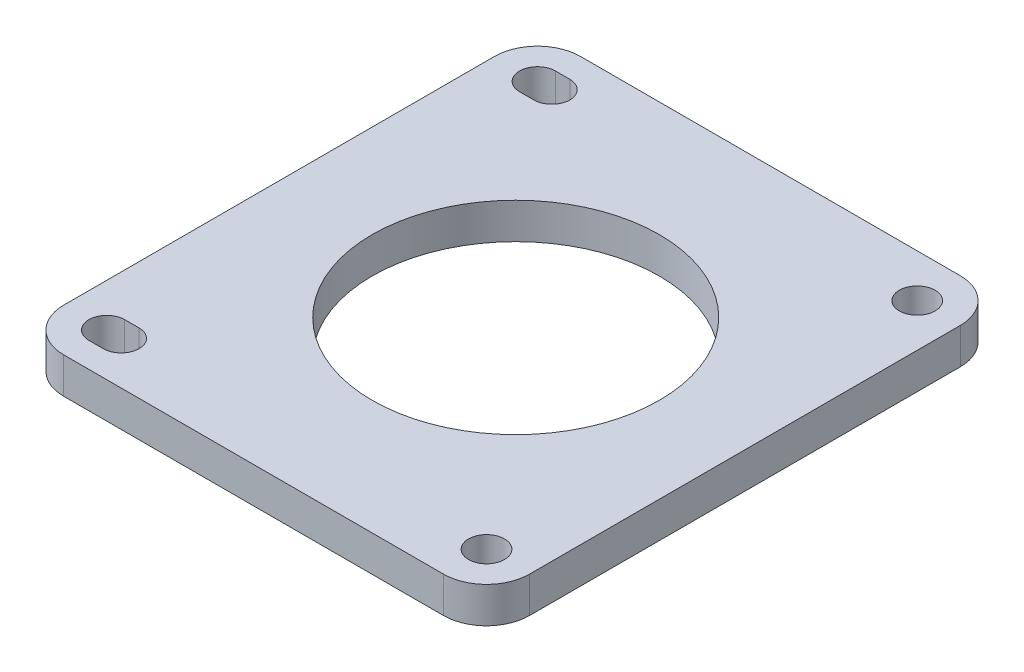
ISO-10303-21;
HEADER;
FILE_DESCRIPTION(('STEP AP214'),'2;1');
FILE_NAME('part.step','',(''),(''),'','','');
FILE_SCHEMA(('AUTOMOTIVE_DESIGN { 1 0 10303 214 1 1 1 1 }'));
ENDSEC;
DATA;
#1=APPLICATION_CONTEXT('core data for automotive mechanical design processes');
#2=APPLICATION_PROTOCOL_DEFINITION('international standard','automotive_design',2000,#1);
#3=PRODUCT_CONTEXT('',#1,'mechanical');
#4=PRODUCT('Part','Part','',(#3));
#5=PRODUCT_RELATED_PRODUCT_CATEGORY('part','',(#4));
#6=PRODUCT_DEFINITION_FORMATION('','',#4);
#7=PRODUCT_DEFINITION_CONTEXT('part definition',#1,'design');
#8=PRODUCT_DEFINITION('design','',#6,#7);
#9=PRODUCT_DEFINITION_SHAPE('','',#8);
#10=(LENGTH_UNIT() NAMED_UNIT(*) SI_UNIT(.MILLI.,.METRE.));
#11=(NAMED_UNIT(*) PLANE_ANGLE_UNIT() SI_UNIT($,.RADIAN.));
#12=(NAMED_UNIT(*) SI_UNIT($,.STERADIAN.) SOLID_ANGLE_UNIT());
#13=UNCERTAINTY_MEASURE_WITH_UNIT(LENGTH_MEASURE(1.E-05),#10,'distance_accuracy_value','');
#14=(GEOMETRIC_REPRESENTATION_CONTEXT(3) GLOBAL_UNCERTAINTY_ASSIGNED_CONTEXT((#13)) GLOBAL_UNIT_ASSIGNED_CONTEXT((#10,
#11,#12)) REPRESENTATION_CONTEXT('',''));
#15=CARTESIAN_POINT('',(0.,0.,0.));
#16=DIRECTION('',(0.,0.,1.));
#17=DIRECTION('',(1.,0.,0.));
#18=AXIS2_PLACEMENT_3D('',#15,#16,#17);
#19=CARTESIAN_POINT('',(6.,5.,-6.));
#20=DIRECTION('',(0.,-1.,0.));
#21=DIRECTION('',(0.,0.,-1.));
#22=AXIS2_PLACEMENT_3D('',#19,#20,#21);
#23=PLANE('',#22);
#24=CARTESIAN_POINT('',(6.,5.,-6.));
#25=DIRECTION('',(0.,1.,0.));
#26=DIRECTION('',(0.,0.,1.));
#27=AXIS2_PLACEMENT_3D('',#24,#25,#26);
#28=CIRCLE('',#27,2.5);
#29=CARTESIAN_POINT('',(6.,5.,-8.5));
#30=VERTEX_POINT('',#29);
#31=CARTESIAN_POINT('',(6.,5.,-3.5));
#32=VERTEX_POINT('',#31);
#33=EDGE_CURVE('E182',#30,#32,#28,.T.);
#34=ORIENTED_EDGE('',*,*,#33,.F.);
#35=DIRECTION('',(-1.,0.,0.));
#36=VECTOR('',#35,1.);
#37=CARTESIAN_POINT('',(6.,5.,-8.5));
#38=LINE('',#37,#36);
#39=CARTESIAN_POINT('',(8.,5.,-8.5));
#40=VERTEX_POINT('',#39);
#41=EDGE_CURVE('E190',#40,#30,#38,.T.);
#42=ORIENTED_EDGE('',*,*,#41,.F.);
#43=CARTESIAN_POINT('',(8.,5.,-6.));
#44=DIRECTION('',(0.,1.,0.));
#45=DIRECTION('',(0.,0.,1.));
#46=AXIS2_PLACEMENT_3D('',#43,#44,#45);
#47=CIRCLE('',#46,2.5);
#48=CARTESIAN_POINT('',(8.,5.,-3.5));
#49=VERTEX_POINT('',#48);
#50=EDGE_CURVE('E187',#49,#40,#47,.T.);
#51=ORIENTED_EDGE('',*,*,#50,.F.);
#52=DIRECTION('',(1.,0.,0.));
#53=VECTOR('',#52,1.);
#54=CARTESIAN_POINT('',(6.,5.,-3.5));
#55=LINE('',#54,#53);
#56=EDGE_CURVE('E184',#32,#49,#55,.T.);
#57=ORIENTED_EDGE('',*,*,#56,.F.);
#58=EDGE_LOOP('',(#34,#42,#51,#57));
#59=FACE_BOUND('',#58,.T.);
#60=CARTESIAN_POINT('',(6.,5.,-6.));
#61=DIRECTION('',(0.,1.,0.));
#62=DIRECTION('',(0.,0.,-1.));
#63=AXIS2_PLACEMENT_3D('',#60,#61,#62);
#64=CIRCLE('',#63,6.);
#65=CARTESIAN_POINT('',(0.,5.,-6.00000000000004));
#66=VERTEX_POINT('',#65);
#67=CARTESIAN_POINT('',(6.00000000000004,5.,0.));
#68=VERTEX_POINT('',#67);
#69=EDGE_CURVE('E231',#66,#68,#64,.T.);
#70=ORIENTED_EDGE('',*,*,#69,.T.);
#71=DIRECTION('',(1.,0.,0.));
#72=VECTOR('',#71,1.);
#73=CARTESIAN_POINT('',(6.00000000000004,5.,0.));
#74=LINE('',#73,#72);
#75=CARTESIAN_POINT('',(58.9,5.,0.));
#76=VERTEX_POINT('',#75);
#77=EDGE_CURVE('E234',#68,#76,#74,.T.);
#78=ORIENTED_EDGE('',*,*,#77,.T.);
#79=CARTESIAN_POINT('',(58.9,5.,-6.));
#80=DIRECTION('',(0.,1.,0.));
#81=DIRECTION('',(0.,0.,1.));
#82=AXIS2_PLACEMENT_3D('',#79,#80,#81);
#83=CIRCLE('',#82,6.);
#84=CARTESIAN_POINT('',(64.9,5.,-6.00000000000004));
#85=VERTEX_POINT('',#84);
#86=EDGE_CURVE('E237',#76,#85,#83,.T.);
#87=ORIENTED_EDGE('',*,*,#86,.T.);
#88=DIRECTION('',(0.,0.,-1.));
#89=VECTOR('',#88,1.);
#90=CARTESIAN_POINT('',(64.9,5.,-6.00000000000004));
#91=LINE('',#90,#89);
#92=CARTESIAN_POINT('',(64.9,5.,-65.9999999999999));
#93=VERTEX_POINT('',#92);
#94=EDGE_CURVE('E239',#85,#93,#91,.T.);
#95=ORIENTED_EDGE('',*,*,#94,.T.);
#96=CARTESIAN_POINT('',(58.9,5.,-66.));
#97=DIRECTION('',(0.,1.,0.));
#98=DIRECTION('',(0.,0.,-1.));
#99=AXIS2_PLACEMENT_3D('',#96,#97,#98);
#100=CIRCLE('',#99,6.);
#101=CARTESIAN_POINT('',(58.9,5.,-72.));
#102=VERTEX_POINT('',#101);
#103=EDGE_CURVE('E241',#93,#102,#100,.T.);
#104=ORIENTED_EDGE('',*,*,#103,.T.);
#105=DIRECTION('',(-1.,0.,0.));
#106=VECTOR('',#105,1.);
#107=CARTESIAN_POINT('',(6.00000000000004,5.,-72.));
#108=LINE('',#107,#106);
#109=CARTESIAN_POINT('',(6.00000000000004,5.,-72.));
#110=VERTEX_POINT('',#109);
#111=EDGE_CURVE('E243',#102,#110,#108,.T.);
#112=ORIENTED_EDGE('',*,*,#111,.T.);
#113=CARTESIAN_POINT('',(6.,5.,-66.));
#114=DIRECTION('',(0.,1.,0.));
#115=DIRECTION('',(0.,0.,-1.));
#116=AXIS2_PLACEMENT_3D('',#113,#114,#115);
#117=CIRCLE('',#116,6.);
#118=CARTESIAN_POINT('',(0.,5.,-65.9999999999999));
#119=VERTEX_POINT('',#118);
#120=EDGE_CURVE('E245',#110,#119,#117,.T.);
#121=ORIENTED_EDGE('',*,*,#120,.T.);
#122=DIRECTION('',(0.,0.,1.));
#123=VECTOR('',#122,1.);
#124=CARTESIAN_POINT('',(0.,5.,-6.00000000000004));
#125=LINE('',#124,#123);
#126=EDGE_CURVE('E247',#119,#66,#125,.T.);
#127=ORIENTED_EDGE('',*,*,#126,.T.);
#128=EDGE_LOOP('',(#70,#78,#87,#95,#104,#112,#121,#127));
#129=FACE_BOUND('',#128,.T.);
#130=CARTESIAN_POINT('',(58.9,5.,-66.));
#131=DIRECTION('',(0.,1.,0.));
#132=DIRECTION('',(0.,0.,1.));
#133=AXIS2_PLACEMENT_3D('',#130,#131,#132);
#134=CIRCLE('',#133,2.5);
#135=CARTESIAN_POINT('',(58.9,5.,-63.5));
#136=VERTEX_POINT('',#135);
#137=EDGE_CURVE('E225',#136,#136,#134,.T.);
#138=ORIENTED_EDGE('',*,*,#137,.F.);
#139=EDGE_LOOP('',(#138));
#140=FACE_BOUND('',#139,.T.);
#141=CARTESIAN_POINT('',(58.9,5.,-6.));
#142=DIRECTION('',(0.,1.,0.));
#143=DIRECTION('',(0.,0.,1.));
#144=AXIS2_PLACEMENT_3D('',#141,#142,#143);
#145=CIRCLE('',#144,2.5);
#146=CARTESIAN_POINT('',(58.9,5.,-3.5));
#147=VERTEX_POINT('',#146);
#148=EDGE_CURVE('E219',#147,#147,#145,.T.);
#149=ORIENTED_EDGE('',*,*,#148,.F.);
#150=EDGE_LOOP('',(#149));
#151=FACE_BOUND('',#150,.T.);
#152=CARTESIAN_POINT('',(32.97,5.,-36.));
#153=DIRECTION('',(0.,1.,0.));
#154=DIRECTION('',(0.,0.,1.));
#155=AXIS2_PLACEMENT_3D('',#152,#153,#154);
#156=CIRCLE('',#155,20.);
#157=CARTESIAN_POINT('',(32.97,5.,-16.));
#158=VERTEX_POINT('',#157);
#159=EDGE_CURVE('E213',#158,#158,#156,.T.);
#160=ORIENTED_EDGE('',*,*,#159,.F.);
#161=EDGE_LOOP('',(#160));
#162=FACE_BOUND('',#161,.T.);
#163=CARTESIAN_POINT('',(6.,5.,-66.));
#164=DIRECTION('',(0.,1.,0.));
#165=DIRECTION('',(0.,0.,1.));
#166=AXIS2_PLACEMENT_3D('',#163,#164,#165);
#167=CIRCLE('',#166,2.5);
#168=CARTESIAN_POINT('',(6.,5.,-68.5));
#169=VERTEX_POINT('',#168);
#170=CARTESIAN_POINT('',(6.,5.,-63.5));
#171=VERTEX_POINT('',#170);
#172=EDGE_CURVE('E146',#169,#171,#167,.T.);
#173=ORIENTED_EDGE('',*,*,#172,.F.);
#174=DIRECTION('',(-1.,0.,0.));
#175=VECTOR('',#174,1.);
#176=CARTESIAN_POINT('',(6.,5.,-68.5));
#177=LINE('',#176,#175);
#178=CARTESIAN_POINT('',(8.,5.,-68.5));
#179=VERTEX_POINT('',#178);
#180=EDGE_CURVE('E168',#179,#169,#177,.T.);
#181=ORIENTED_EDGE('',*,*,#180,.F.);
#182=CARTESIAN_POINT('',(8.,5.,-66.));
#183=DIRECTION('',(0.,1.,0.));
#184=DIRECTION('',(0.,0.,1.));
#185=AXIS2_PLACEMENT_3D('',#182,#183,#184);
#186=CIRCLE('',#185,2.5);
#187=CARTESIAN_POINT('',(8.,5.,-63.5));
#188=VERTEX_POINT('',#187);
#189=EDGE_CURVE('E166',#188,#179,#186,.T.);
#190=ORIENTED_EDGE('',*,*,#189,.F.);
#191=DIRECTION('',(1.,0.,0.));
#192=VECTOR('',#191,1.);
#193=CARTESIAN_POINT('',(6.,5.,-63.5));
#194=LINE('',#193,#192);
#195=EDGE_CURVE('E154',#171,#188,#194,.T.);
#196=ORIENTED_EDGE('',*,*,#195,.F.);
#197=EDGE_LOOP('',(#173,#181,#190,#196));
#198=FACE_BOUND('',#197,.T.);
#199=ADVANCED_FACE('F33',(#59,#129,#140,#151,#162,#198),#23,.F.);
#200=CARTESIAN_POINT('',(6.,0.,-6.));
#201=DIRECTION('',(0.,-1.,0.));
#202=DIRECTION('',(0.,0.,-1.));
#203=AXIS2_PLACEMENT_3D('',#200,#201,#202);
#204=PLANE('',#203);
#205=CARTESIAN_POINT('',(58.9,0.,-6.));
#206=DIRECTION('',(0.,1.,0.));
#207=DIRECTION('',(0.,0.,1.));
#208=AXIS2_PLACEMENT_3D('',#205,#206,#207);
#209=CIRCLE('',#208,2.5);
#210=CARTESIAN_POINT('',(58.9,0.,-3.5));
#211=VERTEX_POINT('',#210);
#212=EDGE_CURVE('E216',#211,#211,#209,.T.);
#213=ORIENTED_EDGE('',*,*,#212,.T.);
#214=EDGE_LOOP('',(#213));
#215=FACE_BOUND('',#214,.T.);
#216=CARTESIAN_POINT('',(6.,0.,-6.));
#217=DIRECTION('',(0.,1.,0.));
#218=DIRECTION('',(0.,0.,-1.));
#219=AXIS2_PLACEMENT_3D('',#216,#217,#218);
#220=CIRCLE('',#219,6.);
#221=CARTESIAN_POINT('',(0.,0.,-6.00000000000004));
#222=VERTEX_POINT('',#221);
#223=CARTESIAN_POINT('',(6.00000000000004,0.,0.));
#224=VERTEX_POINT('',#223);
#225=EDGE_CURVE('E228',#222,#224,#220,.T.);
#226=ORIENTED_EDGE('',*,*,#225,.F.);
#227=DIRECTION('',(0.,0.,1.));
#228=VECTOR('',#227,1.);
#229=CARTESIAN_POINT('',(0.,0.,-6.00000000000004));
#230=LINE('',#229,#228);
#231=CARTESIAN_POINT('',(0.,0.,-65.9999999999999));
#232=VERTEX_POINT('',#231);
#233=EDGE_CURVE('E235',#232,#222,#230,.T.);
#234=ORIENTED_EDGE('',*,*,#233,.F.);
#235=CARTESIAN_POINT('',(6.,0.,-66.));
#236=DIRECTION('',(0.,1.,0.));
#237=DIRECTION('',(0.,0.,-1.));
#238=AXIS2_PLACEMENT_3D('',#235,#236,#237);
#239=CIRCLE('',#238,6.);
#240=CARTESIAN_POINT('',(6.00000000000004,0.,-72.));
#241=VERTEX_POINT('',#240);
#242=EDGE_CURVE('E262',#241,#232,#239,.T.);
#243=ORIENTED_EDGE('',*,*,#242,.F.);
#244=DIRECTION('',(-1.,0.,0.));
#245=VECTOR('',#244,1.);
#246=CARTESIAN_POINT('',(6.00000000000004,0.,-72.));
#247=LINE('',#246,#245);
#248=CARTESIAN_POINT('',(58.9,0.,-72.));
#249=VERTEX_POINT('',#248);
#250=EDGE_CURVE('E260',#249,#241,#247,.T.);
#251=ORIENTED_EDGE('',*,*,#250,.F.);
#252=CARTESIAN_POINT('',(58.9,0.,-66.));
#253=DIRECTION('',(0.,1.,0.));
#254=DIRECTION('',(0.,0.,-1.));
#255=AXIS2_PLACEMENT_3D('',#252,#253,#254);
#256=CIRCLE('',#255,6.);
#257=CARTESIAN_POINT('',(64.9,0.,-65.9999999999999));
#258=VERTEX_POINT('',#257);
#259=EDGE_CURVE('E258',#258,#249,#256,.T.);
#260=ORIENTED_EDGE('',*,*,#259,.F.);
#261=DIRECTION('',(0.,0.,-1.));
#262=VECTOR('',#261,1.);
#263=CARTESIAN_POINT('',(64.9,0.,-6.00000000000004));
#264=LINE('',#263,#262);
#265=CARTESIAN_POINT('',(64.9,0.,-6.00000000000004));
#266=VERTEX_POINT('',#265);
#267=EDGE_CURVE('E256',#266,#258,#264,.T.);
#268=ORIENTED_EDGE('',*,*,#267,.F.);
#269=CARTESIAN_POINT('',(58.9,0.,-6.));
#270=DIRECTION('',(0.,1.,0.));
#271=DIRECTION('',(0.,0.,1.));
#272=AXIS2_PLACEMENT_3D('',#269,#270,#271);
#273=CIRCLE('',#272,6.);
#274=CARTESIAN_POINT('',(58.9,0.,0.));
#275=VERTEX_POINT('',#274);
#276=EDGE_CURVE('E254',#275,#266,#273,.T.);
#277=ORIENTED_EDGE('',*,*,#276,.F.);
#278=DIRECTION('',(1.,0.,0.));
#279=VECTOR('',#278,1.);
#280=CARTESIAN_POINT('',(6.00000000000004,0.,0.));
#281=LINE('',#280,#279);
#282=EDGE_CURVE('E252',#224,#275,#281,.T.);
#283=ORIENTED_EDGE('',*,*,#282,.F.);
#284=EDGE_LOOP('',(#226,#234,#243,#251,#260,#268,#277,#283));
#285=FACE_BOUND('',#284,.T.);
#286=CARTESIAN_POINT('',(58.9,0.,-66.));
#287=DIRECTION('',(0.,1.,0.));
#288=DIRECTION('',(0.,0.,1.));
#289=AXIS2_PLACEMENT_3D('',#286,#287,#288);
#290=CIRCLE('',#289,2.5);
#291=CARTESIAN_POINT('',(58.9,0.,-63.5));
#292=VERTEX_POINT('',#291);
#293=EDGE_CURVE('E222',#292,#292,#290,.T.);
#294=ORIENTED_EDGE('',*,*,#293,.T.);
#295=EDGE_LOOP('',(#294));
#296=FACE_BOUND('',#295,.T.);
#297=CARTESIAN_POINT('',(32.97,0.,-36.));
#298=DIRECTION('',(0.,1.,0.));
#299=DIRECTION('',(0.,0.,1.));
#300=AXIS2_PLACEMENT_3D('',#297,#298,#299);
#301=CIRCLE('',#300,20.);
#302=CARTESIAN_POINT('',(32.97,0.,-16.));
#303=VERTEX_POINT('',#302);
#304=EDGE_CURVE('E212',#303,#303,#301,.T.);
#305=ORIENTED_EDGE('',*,*,#304,.T.);
#306=EDGE_LOOP('',(#305));
#307=FACE_BOUND('',#306,.T.);
#308=DIRECTION('',(-1.,0.,0.));
#309=VECTOR('',#308,1.);
#310=CARTESIAN_POINT('',(6.,0.,-8.5));
#311=LINE('',#310,#309);
#312=CARTESIAN_POINT('',(8.,0.,-8.5));
#313=VERTEX_POINT('',#312);
#314=CARTESIAN_POINT('',(6.,0.,-8.5));
#315=VERTEX_POINT('',#314);
#316=EDGE_CURVE('E185',#313,#315,#311,.T.);
#317=ORIENTED_EDGE('',*,*,#316,.T.);
#318=CARTESIAN_POINT('',(6.,0.,-6.));
#319=DIRECTION('',(0.,1.,0.));
#320=DIRECTION('',(0.,0.,1.));
#321=AXIS2_PLACEMENT_3D('',#318,#319,#320);
#322=CIRCLE('',#321,2.5);
#323=CARTESIAN_POINT('',(6.,0.,-3.5));
#324=VERTEX_POINT('',#323);
#325=EDGE_CURVE('E162',#315,#324,#322,.T.);
#326=ORIENTED_EDGE('',*,*,#325,.T.);
#327=DIRECTION('',(1.,0.,0.));
#328=VECTOR('',#327,1.);
#329=CARTESIAN_POINT('',(6.,0.,-3.5));
#330=LINE('',#329,#328);
#331=CARTESIAN_POINT('',(8.,0.,-3.5));
#332=VERTEX_POINT('',#331);
#333=EDGE_CURVE('E195',#324,#332,#330,.T.);
#334=ORIENTED_EDGE('',*,*,#333,.T.);
#335=CARTESIAN_POINT('',(8.,0.,-6.));
#336=DIRECTION('',(0.,1.,0.));
#337=DIRECTION('',(0.,0.,1.));
#338=AXIS2_PLACEMENT_3D('',#335,#336,#337);
#339=CIRCLE('',#338,2.5);
#340=EDGE_CURVE('E198',#332,#313,#339,.T.);
#341=ORIENTED_EDGE('',*,*,#340,.T.);
#342=EDGE_LOOP('',(#317,#326,#334,#341));
#343=FACE_BOUND('',#342,.T.);
#344=DIRECTION('',(-1.,0.,0.));
#345=VECTOR('',#344,1.);
#346=CARTESIAN_POINT('',(6.,0.,-68.5));
#347=LINE('',#346,#345);
#348=CARTESIAN_POINT('',(8.,0.,-68.5));
#349=VERTEX_POINT('',#348);
#350=CARTESIAN_POINT('',(6.,0.,-68.5));
#351=VERTEX_POINT('',#350);
#352=EDGE_CURVE('E155',#349,#351,#347,.T.);
#353=ORIENTED_EDGE('',*,*,#352,.T.);
#354=CARTESIAN_POINT('',(6.,0.,-66.));
#355=DIRECTION('',(0.,1.,0.));
#356=DIRECTION('',(0.,0.,1.));
#357=AXIS2_PLACEMENT_3D('',#354,#355,#356);
#358=CIRCLE('',#357,2.5);
#359=CARTESIAN_POINT('',(6.,0.,-63.5));
#360=VERTEX_POINT('',#359);
#361=EDGE_CURVE('E56',#351,#360,#358,.T.);
#362=ORIENTED_EDGE('',*,*,#361,.T.);
#363=DIRECTION('',(1.,0.,0.));
#364=VECTOR('',#363,1.);
#365=CARTESIAN_POINT('',(6.,0.,-63.5));
#366=LINE('',#365,#364);
#367=CARTESIAN_POINT('',(8.,0.,-63.5));
#368=VERTEX_POINT('',#367);
#369=EDGE_CURVE('E161',#360,#368,#366,.T.);
#370=ORIENTED_EDGE('',*,*,#369,.T.);
#371=CARTESIAN_POINT('',(8.,0.,-66.));
#372=DIRECTION('',(0.,1.,0.));
#373=DIRECTION('',(0.,0.,1.));
#374=AXIS2_PLACEMENT_3D('',#371,#372,#373);
#375=CIRCLE('',#374,2.5);
#376=EDGE_CURVE('E174',#368,#349,#375,.T.);
#377=ORIENTED_EDGE('',*,*,#376,.T.);
#378=EDGE_LOOP('',(#353,#362,#370,#377));
#379=FACE_BOUND('',#378,.T.);
#380=ADVANCED_FACE('F292',(#215,#285,#296,#307,#343,#379),#204,.T.);
#381=CARTESIAN_POINT('',(6.,5.,-6.));
#382=DIRECTION('',(0.,-1.,0.));
#383=DIRECTION('',(0.,0.,-1.));
#384=AXIS2_PLACEMENT_3D('',#381,#382,#383);
#385=CYLINDRICAL_SURFACE('',#384,6.);
#386=ORIENTED_EDGE('',*,*,#225,.T.);
#387=DIRECTION('',(0.,-1.,0.));
#388=VECTOR('',#387,1.);
#389=CARTESIAN_POINT('',(6.00000000000004,5.,0.));
#390=LINE('',#389,#388);
#391=EDGE_CURVE('E11',#68,#224,#390,.T.);
#392=ORIENTED_EDGE('',*,*,#391,.F.);
#393=ORIENTED_EDGE('',*,*,#69,.F.);
#394=DIRECTION('',(0.,-1.,0.));
#395=VECTOR('',#394,1.);
#396=CARTESIAN_POINT('',(0.,5.,-6.00000000000004));
#397=LINE('',#396,#395);
#398=EDGE_CURVE('E249',#66,#222,#397,.T.);
#399=ORIENTED_EDGE('',*,*,#398,.T.);
#400=EDGE_LOOP('',(#386,#392,#393,#399));
#401=FACE_BOUND('',#400,.T.);
#402=ADVANCED_FACE('F35',(#401),#385,.T.);
#403=CARTESIAN_POINT('',(6.00000000000004,5.,0.));
#404=DIRECTION('',(0.,0.,-1.));
#405=DIRECTION('',(-1.,0.,0.));
#406=AXIS2_PLACEMENT_3D('',#403,#404,#405);
#407=PLANE('',#406);
#408=ORIENTED_EDGE('',*,*,#282,.T.);
#409=DIRECTION('',(0.,-1.,0.));
#410=VECTOR('',#409,1.);
#411=CARTESIAN_POINT('',(58.9,5.,0.));
#412=LINE('',#411,#410);
#413=EDGE_CURVE('E41',#76,#275,#412,.T.);
#414=ORIENTED_EDGE('',*,*,#413,.F.);
#415=ORIENTED_EDGE('',*,*,#77,.F.);
#416=ORIENTED_EDGE('',*,*,#391,.T.);
#417=EDGE_LOOP('',(#408,#414,#415,#416));
#418=FACE_BOUND('',#417,.T.);
#419=ADVANCED_FACE('F310',(#418),#407,.F.);
#420=CARTESIAN_POINT('',(58.9,5.,-6.));
#421=DIRECTION('',(0.,-1.,0.));
#422=DIRECTION('',(0.,0.,-1.));
#423=AXIS2_PLACEMENT_3D('',#420,#421,#422);
#424=CYLINDRICAL_SURFACE('',#423,6.);
#425=ORIENTED_EDGE('',*,*,#276,.T.);
#426=DIRECTION('',(0.,-1.,0.));
#427=VECTOR('',#426,1.);
#428=CARTESIAN_POINT('',(64.9,5.,-6.00000000000004));
#429=LINE('',#428,#427);
#430=EDGE_CURVE('E279',#85,#266,#429,.T.);
#431=ORIENTED_EDGE('',*,*,#430,.F.);
#432=ORIENTED_EDGE('',*,*,#86,.F.);
#433=ORIENTED_EDGE('',*,*,#413,.T.);
#434=EDGE_LOOP('',(#425,#431,#432,#433));
#435=FACE_BOUND('',#434,.T.);
#436=ADVANCED_FACE('F286',(#435),#424,.T.);
#437=CARTESIAN_POINT('',(64.9,5.,-6.00000000000004));
#438=DIRECTION('',(-1.,0.,0.));
#439=DIRECTION('',(0.,0.,1.));
#440=AXIS2_PLACEMENT_3D('',#437,#438,#439);
#441=PLANE('',#440);
#442=ORIENTED_EDGE('',*,*,#267,.T.);
#443=DIRECTION('',(0.,-1.,0.));
#444=VECTOR('',#443,1.);
#445=CARTESIAN_POINT('',(64.9,5.,-65.9999999999999));
#446=LINE('',#445,#444);
#447=EDGE_CURVE('E276',#93,#258,#446,.T.);
#448=ORIENTED_EDGE('',*,*,#447,.F.);
#449=ORIENTED_EDGE('',*,*,#94,.F.);
#450=ORIENTED_EDGE('',*,*,#430,.T.);
#451=EDGE_LOOP('',(#442,#448,#449,#450));
#452=FACE_BOUND('',#451,.T.);
#453=ADVANCED_FACE('F298',(#452),#441,.F.);
#454=CARTESIAN_POINT('',(58.9,5.,-66.));
#455=DIRECTION('',(0.,-1.,0.));
#456=DIRECTION('',(0.,0.,-1.));
#457=AXIS2_PLACEMENT_3D('',#454,#455,#456);
#458=CYLINDRICAL_SURFACE('',#457,6.);
#459=ORIENTED_EDGE('',*,*,#259,.T.);
#460=DIRECTION('',(0.,-1.,0.));
#461=VECTOR('',#460,1.);
#462=CARTESIAN_POINT('',(58.9,5.,-72.));
#463=LINE('',#462,#461);
#464=EDGE_CURVE('E273',#102,#249,#463,.T.);
#465=ORIENTED_EDGE('',*,*,#464,.F.);
#466=ORIENTED_EDGE('',*,*,#103,.F.);
#467=ORIENTED_EDGE('',*,*,#447,.T.);
#468=EDGE_LOOP('',(#459,#465,#466,#467));
#469=FACE_BOUND('',#468,.T.);
#470=ADVANCED_FACE('F302',(#469),#458,.T.);
#471=CARTESIAN_POINT('',(6.00000000000004,5.,-72.));
#472=DIRECTION('',(0.,0.,1.));
#473=DIRECTION('',(1.,0.,0.));
#474=AXIS2_PLACEMENT_3D('',#471,#472,#473);
#475=PLANE('',#474);
#476=ORIENTED_EDGE('',*,*,#250,.T.);
#477=DIRECTION('',(0.,-1.,0.));
#478=VECTOR('',#477,1.);
#479=CARTESIAN_POINT('',(6.00000000000004,5.,-72.));
#480=LINE('',#479,#478);
#481=EDGE_CURVE('E270',#110,#241,#480,.T.);
#482=ORIENTED_EDGE('',*,*,#481,.F.);
#483=ORIENTED_EDGE('',*,*,#111,.F.);
#484=ORIENTED_EDGE('',*,*,#464,.T.);
#485=EDGE_LOOP('',(#476,#482,#483,#484));
#486=FACE_BOUND('',#485,.T.);
#487=ADVANCED_FACE('F323',(#486),#475,.F.);
#488=CARTESIAN_POINT('',(6.,5.,-66.));
#489=DIRECTION('',(0.,-1.,0.));
#490=DIRECTION('',(0.,0.,-1.));
#491=AXIS2_PLACEMENT_3D('',#488,#489,#490);
#492=CYLINDRICAL_SURFACE('',#491,6.);
#493=ORIENTED_EDGE('',*,*,#242,.T.);
#494=DIRECTION('',(0.,-1.,0.));
#495=VECTOR('',#494,1.);
#496=CARTESIAN_POINT('',(0.,5.,-65.9999999999999));
#497=LINE('',#496,#495);
#498=EDGE_CURVE('E267',#119,#232,#497,.T.);
#499=ORIENTED_EDGE('',*,*,#498,.F.);
#500=ORIENTED_EDGE('',*,*,#120,.F.);
#501=ORIENTED_EDGE('',*,*,#481,.T.);
#502=EDGE_LOOP('',(#493,#499,#500,#501));
#503=FACE_BOUND('',#502,.T.);
#504=ADVANCED_FACE('F321',(#503),#492,.T.);
#505=CARTESIAN_POINT('',(0.,5.,-6.00000000000004));
#506=DIRECTION('',(1.,0.,0.));
#507=DIRECTION('',(0.,0.,-1.));
#508=AXIS2_PLACEMENT_3D('',#505,#506,#507);
#509=PLANE('',#508);
#510=ORIENTED_EDGE('',*,*,#233,.T.);
#511=ORIENTED_EDGE('',*,*,#398,.F.);
#512=ORIENTED_EDGE('',*,*,#126,.F.);
#513=ORIENTED_EDGE('',*,*,#498,.T.);
#514=EDGE_LOOP('',(#510,#511,#512,#513));
#515=FACE_BOUND('',#514,.T.);
#516=ADVANCED_FACE('F316',(#515),#509,.F.);
#517=CARTESIAN_POINT('',(58.9,5.,-66.));
#518=DIRECTION('',(0.,-1.,0.));
#519=DIRECTION('',(0.,0.,-1.));
#520=AXIS2_PLACEMENT_3D('',#517,#518,#519);
#521=CYLINDRICAL_SURFACE('',#520,2.5);
#522=ORIENTED_EDGE('',*,*,#137,.T.);
#523=EDGE_LOOP('',(#522));
#524=FACE_BOUND('',#523,.T.);
#525=ORIENTED_EDGE('',*,*,#293,.F.);
#526=EDGE_LOOP('',(#525));
#527=FACE_BOUND('',#526,.T.);
#528=ADVANCED_FACE('F342',(#524,#527),#521,.F.);
#529=CARTESIAN_POINT('',(58.9,5.,-6.));
#530=DIRECTION('',(0.,-1.,0.));
#531=DIRECTION('',(0.,0.,-1.));
#532=AXIS2_PLACEMENT_3D('',#529,#530,#531);
#533=CYLINDRICAL_SURFACE('',#532,2.5);
#534=ORIENTED_EDGE('',*,*,#148,.T.);
#535=EDGE_LOOP('',(#534));
#536=FACE_BOUND('',#535,.T.);
#537=ORIENTED_EDGE('',*,*,#212,.F.);
#538=EDGE_LOOP('',(#537));
#539=FACE_BOUND('',#538,.T.);
#540=ADVANCED_FACE('F349',(#536,#539),#533,.F.);
#541=CARTESIAN_POINT('',(32.97,5.,-36.));
#542=DIRECTION('',(0.,-1.,0.));
#543=DIRECTION('',(0.,0.,-1.));
#544=AXIS2_PLACEMENT_3D('',#541,#542,#543);
#545=CYLINDRICAL_SURFACE('',#544,20.);
#546=ORIENTED_EDGE('',*,*,#159,.T.);
#547=EDGE_LOOP('',(#546));
#548=FACE_BOUND('',#547,.T.);
#549=ORIENTED_EDGE('',*,*,#304,.F.);
#550=EDGE_LOOP('',(#549));
#551=FACE_BOUND('',#550,.T.);
#552=ADVANCED_FACE('F354',(#548,#551),#545,.F.);
#553=CARTESIAN_POINT('',(6.,5.,-6.));
#554=DIRECTION('',(0.,-1.,0.));
#555=DIRECTION('',(0.,0.,-1.));
#556=AXIS2_PLACEMENT_3D('',#553,#554,#555);
#557=CYLINDRICAL_SURFACE('',#556,2.5);
#558=ORIENTED_EDGE('',*,*,#325,.F.);
#559=DIRECTION('',(0.,-1.,0.));
#560=VECTOR('',#559,1.);
#561=CARTESIAN_POINT('',(6.,5.,-8.5));
#562=LINE('',#561,#560);
#563=EDGE_CURVE('E192',#30,#315,#562,.T.);
#564=ORIENTED_EDGE('',*,*,#563,.F.);
#565=ORIENTED_EDGE('',*,*,#33,.T.);
#566=DIRECTION('',(0.,-1.,0.));
#567=VECTOR('',#566,1.);
#568=CARTESIAN_POINT('',(6.,5.,-3.5));
#569=LINE('',#568,#567);
#570=EDGE_CURVE('E209',#32,#324,#569,.T.);
#571=ORIENTED_EDGE('',*,*,#570,.T.);
#572=EDGE_LOOP('',(#558,#564,#565,#571));
#573=FACE_BOUND('',#572,.T.);
#574=ADVANCED_FACE('F390',(#573),#557,.F.);
#575=CARTESIAN_POINT('',(6.,5.,-3.5));
#576=DIRECTION('',(0.,0.,-1.));
#577=DIRECTION('',(-1.,0.,0.));
#578=AXIS2_PLACEMENT_3D('',#575,#576,#577);
#579=PLANE('',#578);
#580=ORIENTED_EDGE('',*,*,#333,.F.);
#581=ORIENTED_EDGE('',*,*,#570,.F.);
#582=ORIENTED_EDGE('',*,*,#56,.T.);
#583=DIRECTION('',(0.,-1.,0.));
#584=VECTOR('',#583,1.);
#585=CARTESIAN_POINT('',(8.,5.,-3.5));
#586=LINE('',#585,#584);
#587=EDGE_CURVE('E207',#49,#332,#586,.T.);
#588=ORIENTED_EDGE('',*,*,#587,.T.);
#589=EDGE_LOOP('',(#580,#581,#582,#588));
#590=FACE_BOUND('',#589,.T.);
#591=ADVANCED_FACE('F386',(#590),#579,.T.);
#592=CARTESIAN_POINT('',(8.,5.,-6.));
#593=DIRECTION('',(0.,-1.,0.));
#594=DIRECTION('',(0.,0.,-1.));
#595=AXIS2_PLACEMENT_3D('',#592,#593,#594);
#596=CYLINDRICAL_SURFACE('',#595,2.5);
#597=ORIENTED_EDGE('',*,*,#340,.F.);
#598=ORIENTED_EDGE('',*,*,#587,.F.);
#599=ORIENTED_EDGE('',*,*,#50,.T.);
#600=DIRECTION('',(0.,-1.,0.));
#601=VECTOR('',#600,1.);
#602=CARTESIAN_POINT('',(8.,5.,-8.5));
#603=LINE('',#602,#601);
#604=EDGE_CURVE('E205',#40,#313,#603,.T.);
#605=ORIENTED_EDGE('',*,*,#604,.T.);
#606=EDGE_LOOP('',(#597,#598,#599,#605));
#607=FACE_BOUND('',#606,.T.);
#608=ADVANCED_FACE('F382',(#607),#596,.F.);
#609=CARTESIAN_POINT('',(6.,5.,-8.5));
#610=DIRECTION('',(0.,0.,1.));
#611=DIRECTION('',(1.,0.,0.));
#612=AXIS2_PLACEMENT_3D('',#609,#610,#611);
#613=PLANE('',#612);
#614=ORIENTED_EDGE('',*,*,#316,.F.);
#615=ORIENTED_EDGE('',*,*,#604,.F.);
#616=ORIENTED_EDGE('',*,*,#41,.T.);
#617=ORIENTED_EDGE('',*,*,#563,.T.);
#618=EDGE_LOOP('',(#614,#615,#616,#617));
#619=FACE_BOUND('',#618,.T.);
#620=ADVANCED_FACE('F379',(#619),#613,.T.);
#621=CARTESIAN_POINT('',(6.,5.,-66.));
#622=DIRECTION('',(0.,-1.,0.));
#623=DIRECTION('',(0.,0.,-1.));
#624=AXIS2_PLACEMENT_3D('',#621,#622,#623);
#625=CYLINDRICAL_SURFACE('',#624,2.5);
#626=ORIENTED_EDGE('',*,*,#361,.F.);
#627=DIRECTION('',(0.,-1.,0.));
#628=VECTOR('',#627,1.);
#629=CARTESIAN_POINT('',(6.,5.,-68.5));
#630=LINE('',#629,#628);
#631=EDGE_CURVE('E150',#169,#351,#630,.T.);
#632=ORIENTED_EDGE('',*,*,#631,.F.);
#633=ORIENTED_EDGE('',*,*,#172,.T.);
#634=DIRECTION('',(0.,-1.,0.));
#635=VECTOR('',#634,1.);
#636=CARTESIAN_POINT('',(6.,5.,-63.5));
#637=LINE('',#636,#635);
#638=EDGE_CURVE('E149',#171,#360,#637,.T.);
#639=ORIENTED_EDGE('',*,*,#638,.T.);
#640=EDGE_LOOP('',(#626,#632,#633,#639));
#641=FACE_BOUND('',#640,.T.);
#642=ADVANCED_FACE('F148',(#641),#625,.F.);
#643=CARTESIAN_POINT('',(6.,5.,-63.5));
#644=DIRECTION('',(0.,0.,-1.));
#645=DIRECTION('',(-1.,0.,0.));
#646=AXIS2_PLACEMENT_3D('',#643,#644,#645);
#647=PLANE('',#646);
#648=ORIENTED_EDGE('',*,*,#369,.F.);
#649=ORIENTED_EDGE('',*,*,#638,.F.);
#650=ORIENTED_EDGE('',*,*,#195,.T.);
#651=DIRECTION('',(0.,-1.,0.));
#652=VECTOR('',#651,1.);
#653=CARTESIAN_POINT('',(8.,5.,-63.5));
#654=LINE('',#653,#652);
#655=EDGE_CURVE('E163',#188,#368,#654,.T.);
#656=ORIENTED_EDGE('',*,*,#655,.T.);
#657=EDGE_LOOP('',(#648,#649,#650,#656));
#658=FACE_BOUND('',#657,.T.);
#659=ADVANCED_FACE('F158',(#658),#647,.T.);
#660=CARTESIAN_POINT('',(8.,5.,-66.));
#661=DIRECTION('',(0.,-1.,0.));
#662=DIRECTION('',(0.,0.,-1.));
#663=AXIS2_PLACEMENT_3D('',#660,#661,#662);
#664=CYLINDRICAL_SURFACE('',#663,2.5);
#665=ORIENTED_EDGE('',*,*,#376,.F.);
#666=ORIENTED_EDGE('',*,*,#655,.F.);
#667=ORIENTED_EDGE('',*,*,#189,.T.);
#668=DIRECTION('',(0.,-1.,0.));
#669=VECTOR('',#668,1.);
#670=CARTESIAN_POINT('',(8.,5.,-68.5));
#671=LINE('',#670,#669);
#672=EDGE_CURVE('E48',#179,#349,#671,.T.);
#673=ORIENTED_EDGE('',*,*,#672,.T.);
#674=EDGE_LOOP('',(#665,#666,#667,#673));
#675=FACE_BOUND('',#674,.T.);
#676=ADVANCED_FACE('F367',(#675),#664,.F.);
#677=CARTESIAN_POINT('',(6.,5.,-68.5));
#678=DIRECTION('',(0.,0.,1.));
#679=DIRECTION('',(1.,0.,0.));
#680=AXIS2_PLACEMENT_3D('',#677,#678,#679);
#681=PLANE('',#680);
#682=ORIENTED_EDGE('',*,*,#352,.F.);
#683=ORIENTED_EDGE('',*,*,#672,.F.);
#684=ORIENTED_EDGE('',*,*,#180,.T.);
#685=ORIENTED_EDGE('',*,*,#631,.T.);
#686=EDGE_LOOP('',(#682,#683,#684,#685));
#687=FACE_BOUND('',#686,.T.);
#688=ADVANCED_FACE('F365',(#687),#681,.T.);
#689=CLOSED_SHELL('',(#199,#380,#402,#419,#436,#453,#470,#487,#504,#516,#528,#540,#552,#574,
#591,#608,#620,#642,#659,#676,#688));
#690=MANIFOLD_SOLID_BREP('B2',#689);
#691=ADVANCED_BREP_SHAPE_REPRESENTATION('',(#18,#690),#14);
#692=SHAPE_DEFINITION_REPRESENTATION(#9,#691);
ENDSEC;
END-ISO-10303-21;
